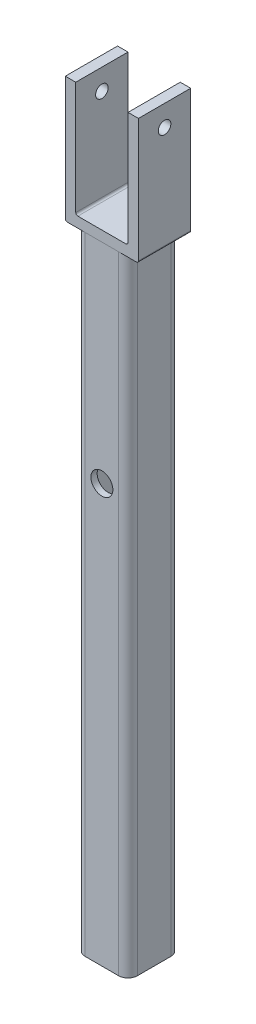
ISO-10303-21;
HEADER;
FILE_DESCRIPTION(('STEP AP214'),'2;1');
FILE_NAME('part.step','',(''),(''),'','','');
FILE_SCHEMA(('AUTOMOTIVE_DESIGN { 1 0 10303 214 1 1 1 1 }'));
ENDSEC;
DATA;
#1=APPLICATION_CONTEXT('core data for automotive mechanical design processes');
#2=APPLICATION_PROTOCOL_DEFINITION('international standard','automotive_design',2000,#1);
#3=PRODUCT_CONTEXT('',#1,'mechanical');
#4=PRODUCT('Part','Part','',(#3));
#5=PRODUCT_RELATED_PRODUCT_CATEGORY('part','',(#4));
#6=PRODUCT_DEFINITION_FORMATION('','',#4);
#7=PRODUCT_DEFINITION_CONTEXT('part definition',#1,'design');
#8=PRODUCT_DEFINITION('design','',#6,#7);
#9=PRODUCT_DEFINITION_SHAPE('','',#8);
#10=(LENGTH_UNIT() NAMED_UNIT(*) SI_UNIT(.MILLI.,.METRE.));
#11=(NAMED_UNIT(*) PLANE_ANGLE_UNIT() SI_UNIT($,.RADIAN.));
#12=(NAMED_UNIT(*) SI_UNIT($,.STERADIAN.) SOLID_ANGLE_UNIT());
#13=UNCERTAINTY_MEASURE_WITH_UNIT(LENGTH_MEASURE(1.E-05),#10,'distance_accuracy_value','');
#14=(GEOMETRIC_REPRESENTATION_CONTEXT(3) GLOBAL_UNCERTAINTY_ASSIGNED_CONTEXT((#13)) GLOBAL_UNIT_ASSIGNED_CONTEXT((#10,
#11,#12)) REPRESENTATION_CONTEXT('',''));
#15=CARTESIAN_POINT('',(0.,0.,0.));
#16=DIRECTION('',(0.,0.,1.));
#17=DIRECTION('',(1.,0.,0.));
#18=AXIS2_PLACEMENT_3D('',#15,#16,#17);
#19=CARTESIAN_POINT('',(0.,360.,0.));
#20=DIRECTION('',(0.,-1.,0.));
#21=DIRECTION('',(0.,0.,-1.));
#22=AXIS2_PLACEMENT_3D('',#19,#20,#21);
#23=PLANE('',#22);
#24=DIRECTION('',(1.,0.,0.));
#25=VECTOR('',#24,1.);
#26=CARTESIAN_POINT('',(17.5,360.,12.5));
#27=LINE('',#26,#25);
#28=CARTESIAN_POINT('',(-17.5,360.,12.5));
#29=VERTEX_POINT('',#28);
#30=CARTESIAN_POINT('',(-12.5,360.,12.5));
#31=VERTEX_POINT('',#30);
#32=EDGE_CURVE('E147',#29,#31,#27,.T.);
#33=ORIENTED_EDGE('',*,*,#32,.T.);
#34=DIRECTION('',(0.,0.,1.));
#35=VECTOR('',#34,1.);
#36=CARTESIAN_POINT('',(-12.5,360.,12.5));
#37=LINE('',#36,#35);
#38=CARTESIAN_POINT('',(-12.5,360.,-12.5));
#39=VERTEX_POINT('',#38);
#40=EDGE_CURVE('E157',#39,#31,#37,.T.);
#41=ORIENTED_EDGE('',*,*,#40,.F.);
#42=DIRECTION('',(-1.,0.,0.));
#43=VECTOR('',#42,1.);
#44=CARTESIAN_POINT('',(17.5,360.,-12.5));
#45=LINE('',#44,#43);
#46=CARTESIAN_POINT('',(-17.5,360.,-12.5));
#47=VERTEX_POINT('',#46);
#48=EDGE_CURVE('E172',#39,#47,#45,.T.);
#49=ORIENTED_EDGE('',*,*,#48,.T.);
#50=DIRECTION('',(0.,0.,1.));
#51=VECTOR('',#50,1.);
#52=CARTESIAN_POINT('',(-17.5,360.,-12.5));
#53=LINE('',#52,#51);
#54=EDGE_CURVE('E167',#47,#29,#53,.T.);
#55=ORIENTED_EDGE('',*,*,#54,.T.);
#56=EDGE_LOOP('',(#33,#41,#49,#55));
#57=FACE_BOUND('',#56,.T.);
#58=ADVANCED_FACE('F52',(#57),#23,.F.);
#59=CARTESIAN_POINT('',(-17.5,360.,-12.5));
#60=DIRECTION('',(1.,0.,0.));
#61=DIRECTION('',(0.,0.,-1.));
#62=AXIS2_PLACEMENT_3D('',#59,#60,#61);
#63=PLANE('',#62);
#64=CARTESIAN_POINT('',(-17.5,350.,0.));
#65=DIRECTION('',(-1.,0.,0.));
#66=DIRECTION('',(0.,0.,1.));
#67=AXIS2_PLACEMENT_3D('',#64,#65,#66);
#68=CIRCLE('',#67,3.);
#69=CARTESIAN_POINT('',(-17.5,350.,3.));
#70=VERTEX_POINT('',#69);
#71=EDGE_CURVE('E200',#70,#70,#68,.T.);
#72=ORIENTED_EDGE('',*,*,#71,.F.);
#73=EDGE_LOOP('',(#72));
#74=FACE_BOUND('',#73,.T.);
#75=DIRECTION('',(0.,-1.,0.));
#76=VECTOR('',#75,1.);
#77=CARTESIAN_POINT('',(-17.5,360.,-12.5));
#78=LINE('',#77,#76);
#79=CARTESIAN_POINT('',(-17.5,301.,-12.5));
#80=VERTEX_POINT('',#79);
#81=EDGE_CURVE('E179',#47,#80,#78,.T.);
#82=ORIENTED_EDGE('',*,*,#81,.T.);
#83=DIRECTION('',(0.,0.,1.));
#84=VECTOR('',#83,1.);
#85=CARTESIAN_POINT('',(-17.5,301.,12.5));
#86=LINE('',#85,#84);
#87=CARTESIAN_POINT('',(-17.5,301.,12.5));
#88=VERTEX_POINT('',#87);
#89=EDGE_CURVE('E13',#80,#88,#86,.T.);
#90=ORIENTED_EDGE('',*,*,#89,.T.);
#91=DIRECTION('',(0.,-1.,0.));
#92=VECTOR('',#91,1.);
#93=CARTESIAN_POINT('',(-17.5,360.,12.5));
#94=LINE('',#93,#92);
#95=EDGE_CURVE('E193',#29,#88,#94,.T.);
#96=ORIENTED_EDGE('',*,*,#95,.F.);
#97=ORIENTED_EDGE('',*,*,#54,.F.);
#98=EDGE_LOOP('',(#82,#90,#96,#97));
#99=FACE_BOUND('',#98,.T.);
#100=ADVANCED_FACE('F244',(#74,#99),#63,.F.);
#101=CARTESIAN_POINT('',(17.5,360.,12.5));
#102=DIRECTION('',(0.,0.,-1.));
#103=DIRECTION('',(-1.,0.,0.));
#104=AXIS2_PLACEMENT_3D('',#101,#102,#103);
#105=PLANE('',#104);
#106=DIRECTION('',(1.,0.,0.));
#107=VECTOR('',#106,1.);
#108=CARTESIAN_POINT('',(17.5,300.,12.5));
#109=LINE('',#108,#107);
#110=CARTESIAN_POINT('',(-16.5,300.,12.5));
#111=VERTEX_POINT('',#110);
#112=CARTESIAN_POINT('',(16.5,300.,12.5));
#113=VERTEX_POINT('',#112);
#114=EDGE_CURVE('E180',#111,#113,#109,.T.);
#115=ORIENTED_EDGE('',*,*,#114,.T.);
#116=CARTESIAN_POINT('',(16.5,301.,12.5));
#117=DIRECTION('',(0.,0.,-1.));
#118=DIRECTION('',(-1.,0.,0.));
#119=AXIS2_PLACEMENT_3D('',#116,#117,#118);
#120=CIRCLE('',#119,1.);
#121=CARTESIAN_POINT('',(17.5,301.,12.5));
#122=VERTEX_POINT('',#121);
#123=EDGE_CURVE('E60',#113,#122,#120,.F.);
#124=ORIENTED_EDGE('',*,*,#123,.T.);
#125=DIRECTION('',(0.,-1.,0.));
#126=VECTOR('',#125,1.);
#127=CARTESIAN_POINT('',(17.5,360.,12.5));
#128=LINE('',#127,#126);
#129=CARTESIAN_POINT('',(17.5,360.,12.5));
#130=VERTEX_POINT('',#129);
#131=EDGE_CURVE('E190',#130,#122,#128,.T.);
#132=ORIENTED_EDGE('',*,*,#131,.F.);
#133=CARTESIAN_POINT('',(12.5,360.,12.5));
#134=VERTEX_POINT('',#133);
#135=EDGE_CURVE('E170',#134,#130,#27,.T.);
#136=ORIENTED_EDGE('',*,*,#135,.F.);
#137=DIRECTION('',(0.,1.,0.));
#138=VECTOR('',#137,1.);
#139=CARTESIAN_POINT('',(12.5,305.,12.5));
#140=LINE('',#139,#138);
#141=CARTESIAN_POINT('',(12.5,306.,12.5));
#142=VERTEX_POINT('',#141);
#143=EDGE_CURVE('E153',#142,#134,#140,.T.);
#144=ORIENTED_EDGE('',*,*,#143,.F.);
#145=CARTESIAN_POINT('',(11.5,306.,12.5));
#146=DIRECTION('',(0.,0.,-1.));
#147=DIRECTION('',(-1.,0.,0.));
#148=AXIS2_PLACEMENT_3D('',#145,#146,#147);
#149=CIRCLE('',#148,1.);
#150=CARTESIAN_POINT('',(11.5,305.,12.5));
#151=VERTEX_POINT('',#150);
#152=EDGE_CURVE('E212',#142,#151,#149,.T.);
#153=ORIENTED_EDGE('',*,*,#152,.T.);
#154=DIRECTION('',(1.,0.,0.));
#155=VECTOR('',#154,1.);
#156=CARTESIAN_POINT('',(12.5,305.,12.5));
#157=LINE('',#156,#155);
#158=CARTESIAN_POINT('',(-11.5,305.,12.5));
#159=VERTEX_POINT('',#158);
#160=EDGE_CURVE('E396',#159,#151,#157,.T.);
#161=ORIENTED_EDGE('',*,*,#160,.F.);
#162=CARTESIAN_POINT('',(-11.5,306.,12.5));
#163=DIRECTION('',(0.,0.,-1.));
#164=DIRECTION('',(-1.,0.,0.));
#165=AXIS2_PLACEMENT_3D('',#162,#163,#164);
#166=CIRCLE('',#165,1.);
#167=CARTESIAN_POINT('',(-12.5,306.,12.5));
#168=VERTEX_POINT('',#167);
#169=EDGE_CURVE('E150',#159,#168,#166,.T.);
#170=ORIENTED_EDGE('',*,*,#169,.T.);
#171=DIRECTION('',(0.,1.,0.));
#172=VECTOR('',#171,1.);
#173=CARTESIAN_POINT('',(-12.5,305.,12.5));
#174=LINE('',#173,#172);
#175=EDGE_CURVE('E142',#168,#31,#174,.T.);
#176=ORIENTED_EDGE('',*,*,#175,.T.);
#177=ORIENTED_EDGE('',*,*,#32,.F.);
#178=ORIENTED_EDGE('',*,*,#95,.T.);
#179=CARTESIAN_POINT('',(-16.5,301.,12.5));
#180=DIRECTION('',(0.,0.,-1.));
#181=DIRECTION('',(-1.,0.,0.));
#182=AXIS2_PLACEMENT_3D('',#179,#180,#181);
#183=CIRCLE('',#182,1.);
#184=EDGE_CURVE('E67',#88,#111,#183,.F.);
#185=ORIENTED_EDGE('',*,*,#184,.T.);
#186=EDGE_LOOP('',(#115,#124,#132,#136,#144,#153,#161,#170,#176,#177,#178,#185));
#187=FACE_BOUND('',#186,.T.);
#188=ADVANCED_FACE('F144',(#187),#105,.F.);
#189=CARTESIAN_POINT('',(17.5,360.,-12.5));
#190=DIRECTION('',(-1.,0.,0.));
#191=DIRECTION('',(0.,0.,1.));
#192=AXIS2_PLACEMENT_3D('',#189,#190,#191);
#193=PLANE('',#192);
#194=CARTESIAN_POINT('',(17.5,350.,0.));
#195=DIRECTION('',(-1.,0.,0.));
#196=DIRECTION('',(0.,0.,1.));
#197=AXIS2_PLACEMENT_3D('',#194,#195,#196);
#198=CIRCLE('',#197,3.);
#199=CARTESIAN_POINT('',(17.5,350.,3.));
#200=VERTEX_POINT('',#199);
#201=EDGE_CURVE('E164',#200,#200,#198,.T.);
#202=ORIENTED_EDGE('',*,*,#201,.T.);
#203=EDGE_LOOP('',(#202));
#204=FACE_BOUND('',#203,.T.);
#205=ORIENTED_EDGE('',*,*,#131,.T.);
#206=DIRECTION('',(0.,0.,-1.));
#207=VECTOR('',#206,1.);
#208=CARTESIAN_POINT('',(17.5,301.,-12.5));
#209=LINE('',#208,#207);
#210=CARTESIAN_POINT('',(17.5,301.,-12.5));
#211=VERTEX_POINT('',#210);
#212=EDGE_CURVE('E217',#122,#211,#209,.T.);
#213=ORIENTED_EDGE('',*,*,#212,.T.);
#214=DIRECTION('',(0.,-1.,0.));
#215=VECTOR('',#214,1.);
#216=CARTESIAN_POINT('',(17.5,360.,-12.5));
#217=LINE('',#216,#215);
#218=CARTESIAN_POINT('',(17.5,360.,-12.5));
#219=VERTEX_POINT('',#218);
#220=EDGE_CURVE('E187',#219,#211,#217,.T.);
#221=ORIENTED_EDGE('',*,*,#220,.F.);
#222=DIRECTION('',(0.,0.,-1.));
#223=VECTOR('',#222,1.);
#224=CARTESIAN_POINT('',(17.5,360.,-12.5));
#225=LINE('',#224,#223);
#226=EDGE_CURVE('E169',#130,#219,#225,.T.);
#227=ORIENTED_EDGE('',*,*,#226,.F.);
#228=EDGE_LOOP('',(#205,#213,#221,#227));
#229=FACE_BOUND('',#228,.T.);
#230=ADVANCED_FACE('F234',(#204,#229),#193,.F.);
#231=CARTESIAN_POINT('',(17.5,360.,-12.5));
#232=DIRECTION('',(0.,0.,1.));
#233=DIRECTION('',(1.,0.,0.));
#234=AXIS2_PLACEMENT_3D('',#231,#232,#233);
#235=PLANE('',#234);
#236=ORIENTED_EDGE('',*,*,#220,.T.);
#237=CARTESIAN_POINT('',(16.5,301.,-12.5));
#238=DIRECTION('',(0.,0.,1.));
#239=DIRECTION('',(1.,0.,0.));
#240=AXIS2_PLACEMENT_3D('',#237,#238,#239);
#241=CIRCLE('',#240,1.);
#242=CARTESIAN_POINT('',(16.5,300.,-12.5));
#243=VERTEX_POINT('',#242);
#244=EDGE_CURVE('E222',#211,#243,#241,.F.);
#245=ORIENTED_EDGE('',*,*,#244,.T.);
#246=DIRECTION('',(-1.,0.,0.));
#247=VECTOR('',#246,1.);
#248=CARTESIAN_POINT('',(17.5,300.,-12.5));
#249=LINE('',#248,#247);
#250=CARTESIAN_POINT('',(-16.5,300.,-12.5));
#251=VERTEX_POINT('',#250);
#252=EDGE_CURVE('E182',#243,#251,#249,.T.);
#253=ORIENTED_EDGE('',*,*,#252,.T.);
#254=CARTESIAN_POINT('',(-16.5,301.,-12.5));
#255=DIRECTION('',(0.,0.,1.));
#256=DIRECTION('',(1.,0.,0.));
#257=AXIS2_PLACEMENT_3D('',#254,#255,#256);
#258=CIRCLE('',#257,1.);
#259=EDGE_CURVE('E220',#251,#80,#258,.F.);
#260=ORIENTED_EDGE('',*,*,#259,.T.);
#261=ORIENTED_EDGE('',*,*,#81,.F.);
#262=ORIENTED_EDGE('',*,*,#48,.F.);
#263=DIRECTION('',(0.,1.,0.));
#264=VECTOR('',#263,1.);
#265=CARTESIAN_POINT('',(-12.5,305.,-12.5));
#266=LINE('',#265,#264);
#267=CARTESIAN_POINT('',(-12.5,306.,-12.5));
#268=VERTEX_POINT('',#267);
#269=EDGE_CURVE('E160',#268,#39,#266,.T.);
#270=ORIENTED_EDGE('',*,*,#269,.F.);
#271=CARTESIAN_POINT('',(-11.5,306.,-12.5));
#272=DIRECTION('',(0.,0.,1.));
#273=DIRECTION('',(1.,0.,0.));
#274=AXIS2_PLACEMENT_3D('',#271,#272,#273);
#275=CIRCLE('',#274,1.);
#276=CARTESIAN_POINT('',(-11.5,305.,-12.5));
#277=VERTEX_POINT('',#276);
#278=EDGE_CURVE('E215',#268,#277,#275,.T.);
#279=ORIENTED_EDGE('',*,*,#278,.T.);
#280=DIRECTION('',(-1.,0.,0.));
#281=VECTOR('',#280,1.);
#282=CARTESIAN_POINT('',(12.5,305.,-12.5));
#283=LINE('',#282,#281);
#284=CARTESIAN_POINT('',(11.5,305.,-12.5));
#285=VERTEX_POINT('',#284);
#286=EDGE_CURVE('E154',#285,#277,#283,.T.);
#287=ORIENTED_EDGE('',*,*,#286,.F.);
#288=CARTESIAN_POINT('',(11.5,306.,-12.5));
#289=DIRECTION('',(0.,0.,1.));
#290=DIRECTION('',(1.,0.,0.));
#291=AXIS2_PLACEMENT_3D('',#288,#289,#290);
#292=CIRCLE('',#291,1.);
#293=CARTESIAN_POINT('',(12.5,306.,-12.5));
#294=VERTEX_POINT('',#293);
#295=EDGE_CURVE('E210',#285,#294,#292,.T.);
#296=ORIENTED_EDGE('',*,*,#295,.T.);
#297=DIRECTION('',(0.,1.,0.));
#298=VECTOR('',#297,1.);
#299=CARTESIAN_POINT('',(12.5,305.,-12.5));
#300=LINE('',#299,#298);
#301=CARTESIAN_POINT('',(12.5,360.,-12.5));
#302=VERTEX_POINT('',#301);
#303=EDGE_CURVE('E390',#294,#302,#300,.T.);
#304=ORIENTED_EDGE('',*,*,#303,.T.);
#305=EDGE_CURVE('E176',#219,#302,#45,.T.);
#306=ORIENTED_EDGE('',*,*,#305,.F.);
#307=EDGE_LOOP('',(#236,#245,#253,#260,#261,#262,#270,#279,#287,#296,#304,#306));
#308=FACE_BOUND('',#307,.T.);
#309=ADVANCED_FACE('F238',(#308),#235,.F.);
#310=ORIENTED_EDGE('',*,*,#305,.T.);
#311=DIRECTION('',(0.,0.,-1.));
#312=VECTOR('',#311,1.);
#313=CARTESIAN_POINT('',(12.5,360.,12.5));
#314=LINE('',#313,#312);
#315=EDGE_CURVE('E163',#134,#302,#314,.T.);
#316=ORIENTED_EDGE('',*,*,#315,.F.);
#317=ORIENTED_EDGE('',*,*,#135,.T.);
#318=ORIENTED_EDGE('',*,*,#226,.T.);
#319=EDGE_LOOP('',(#310,#316,#317,#318));
#320=FACE_BOUND('',#319,.T.);
#321=ADVANCED_FACE('F254',(#320),#23,.F.);
#322=CARTESIAN_POINT('',(0.,300.,0.));
#323=DIRECTION('',(0.,-1.,0.));
#324=DIRECTION('',(0.,0.,-1.));
#325=AXIS2_PLACEMENT_3D('',#322,#323,#324);
#326=PLANE('',#325);
#327=ORIENTED_EDGE('',*,*,#252,.F.);
#328=DIRECTION('',(0.,0.,-1.));
#329=VECTOR('',#328,1.);
#330=CARTESIAN_POINT('',(16.5,300.,12.5));
#331=LINE('',#330,#329);
#332=EDGE_CURVE('E74',#243,#113,#331,.F.);
#333=ORIENTED_EDGE('',*,*,#332,.T.);
#334=ORIENTED_EDGE('',*,*,#114,.F.);
#335=DIRECTION('',(0.,0.,1.));
#336=VECTOR('',#335,1.);
#337=CARTESIAN_POINT('',(-16.5,300.,-12.5));
#338=LINE('',#337,#336);
#339=EDGE_CURVE('E224',#111,#251,#338,.F.);
#340=ORIENTED_EDGE('',*,*,#339,.T.);
#341=EDGE_LOOP('',(#327,#333,#334,#340));
#342=FACE_BOUND('',#341,.T.);
#343=ADVANCED_FACE('F241',(#342),#326,.T.);
#344=CARTESIAN_POINT('',(-12.5,305.,12.5));
#345=DIRECTION('',(-1.,0.,0.));
#346=DIRECTION('',(0.,0.,1.));
#347=AXIS2_PLACEMENT_3D('',#344,#345,#346);
#348=PLANE('',#347);
#349=CARTESIAN_POINT('',(-12.5,350.,0.));
#350=DIRECTION('',(-1.,0.,0.));
#351=DIRECTION('',(0.,0.,1.));
#352=AXIS2_PLACEMENT_3D('',#349,#350,#351);
#353=CIRCLE('',#352,3.);
#354=CARTESIAN_POINT('',(-12.5,350.,3.));
#355=VERTEX_POINT('',#354);
#356=EDGE_CURVE('E199',#355,#355,#353,.T.);
#357=ORIENTED_EDGE('',*,*,#356,.T.);
#358=EDGE_LOOP('',(#357));
#359=FACE_BOUND('',#358,.T.);
#360=ORIENTED_EDGE('',*,*,#175,.F.);
#361=DIRECTION('',(0.,0.,1.));
#362=VECTOR('',#361,1.);
#363=CARTESIAN_POINT('',(-12.5,306.,12.5));
#364=LINE('',#363,#362);
#365=EDGE_CURVE('E208',#168,#268,#364,.F.);
#366=ORIENTED_EDGE('',*,*,#365,.T.);
#367=ORIENTED_EDGE('',*,*,#269,.T.);
#368=ORIENTED_EDGE('',*,*,#40,.T.);
#369=EDGE_LOOP('',(#360,#366,#367,#368));
#370=FACE_BOUND('',#369,.T.);
#371=ADVANCED_FACE('F158',(#359,#370),#348,.F.);
#372=CARTESIAN_POINT('',(12.5,305.,12.5));
#373=DIRECTION('',(1.,0.,0.));
#374=DIRECTION('',(0.,0.,-1.));
#375=AXIS2_PLACEMENT_3D('',#372,#373,#374);
#376=PLANE('',#375);
#377=CARTESIAN_POINT('',(12.5,350.,0.));
#378=DIRECTION('',(1.,0.,0.));
#379=DIRECTION('',(0.,0.,-1.));
#380=AXIS2_PLACEMENT_3D('',#377,#378,#379);
#381=CIRCLE('',#380,3.);
#382=CARTESIAN_POINT('',(12.5,350.,-3.));
#383=VERTEX_POINT('',#382);
#384=EDGE_CURVE('E196',#383,#383,#381,.T.);
#385=ORIENTED_EDGE('',*,*,#384,.T.);
#386=EDGE_LOOP('',(#385));
#387=FACE_BOUND('',#386,.T.);
#388=ORIENTED_EDGE('',*,*,#303,.F.);
#389=DIRECTION('',(0.,0.,-1.));
#390=VECTOR('',#389,1.);
#391=CARTESIAN_POINT('',(12.5,306.,12.5));
#392=LINE('',#391,#390);
#393=EDGE_CURVE('E206',#294,#142,#392,.F.);
#394=ORIENTED_EDGE('',*,*,#393,.T.);
#395=ORIENTED_EDGE('',*,*,#143,.T.);
#396=ORIENTED_EDGE('',*,*,#315,.T.);
#397=EDGE_LOOP('',(#388,#394,#395,#396));
#398=FACE_BOUND('',#397,.T.);
#399=ADVANCED_FACE('F339',(#387,#398),#376,.F.);
#400=CARTESIAN_POINT('',(0.,305.,0.));
#401=DIRECTION('',(0.,1.,0.));
#402=DIRECTION('',(0.,0.,1.));
#403=AXIS2_PLACEMENT_3D('',#400,#401,#402);
#404=PLANE('',#403);
#405=ORIENTED_EDGE('',*,*,#160,.T.);
#406=DIRECTION('',(0.,0.,-1.));
#407=VECTOR('',#406,1.);
#408=CARTESIAN_POINT('',(11.5,305.,0.));
#409=LINE('',#408,#407);
#410=EDGE_CURVE('E203',#151,#285,#409,.T.);
#411=ORIENTED_EDGE('',*,*,#410,.T.);
#412=ORIENTED_EDGE('',*,*,#286,.T.);
#413=DIRECTION('',(0.,0.,1.));
#414=VECTOR('',#413,1.);
#415=CARTESIAN_POINT('',(-11.5,305.,0.));
#416=LINE('',#415,#414);
#417=EDGE_CURVE('E195',#277,#159,#416,.T.);
#418=ORIENTED_EDGE('',*,*,#417,.T.);
#419=EDGE_LOOP('',(#405,#411,#412,#418));
#420=FACE_BOUND('',#419,.T.);
#421=ADVANCED_FACE('F333',(#420),#404,.T.);
#422=CARTESIAN_POINT('',(37.5,350.,0.));
#423=DIRECTION('',(-1.,0.,0.));
#424=DIRECTION('',(0.,0.,1.));
#425=AXIS2_PLACEMENT_3D('',#422,#423,#424);
#426=CYLINDRICAL_SURFACE('',#425,3.);
#427=ORIENTED_EDGE('',*,*,#384,.F.);
#428=EDGE_LOOP('',(#427));
#429=FACE_BOUND('',#428,.T.);
#430=ORIENTED_EDGE('',*,*,#201,.F.);
#431=EDGE_LOOP('',(#430));
#432=FACE_BOUND('',#431,.T.);
#433=ADVANCED_FACE('F338',(#429,#432),#426,.F.);
#434=ORIENTED_EDGE('',*,*,#71,.T.);
#435=EDGE_LOOP('',(#434));
#436=FACE_BOUND('',#435,.T.);
#437=ORIENTED_EDGE('',*,*,#356,.F.);
#438=EDGE_LOOP('',(#437));
#439=FACE_BOUND('',#438,.T.);
#440=ADVANCED_FACE('F262',(#436,#439),#426,.F.);
#441=CARTESIAN_POINT('',(11.5,306.,0.));
#442=DIRECTION('',(0.,0.,-1.));
#443=DIRECTION('',(-1.,0.,0.));
#444=AXIS2_PLACEMENT_3D('',#441,#442,#443);
#445=CYLINDRICAL_SURFACE('',#444,1.);
#446=ORIENTED_EDGE('',*,*,#152,.F.);
#447=ORIENTED_EDGE('',*,*,#393,.F.);
#448=ORIENTED_EDGE('',*,*,#295,.F.);
#449=ORIENTED_EDGE('',*,*,#410,.F.);
#450=EDGE_LOOP('',(#446,#447,#448,#449));
#451=FACE_BOUND('',#450,.T.);
#452=ADVANCED_FACE('F258',(#451),#445,.F.);
#453=CARTESIAN_POINT('',(-11.5,306.,0.));
#454=DIRECTION('',(0.,0.,1.));
#455=DIRECTION('',(1.,0.,0.));
#456=AXIS2_PLACEMENT_3D('',#453,#454,#455);
#457=CYLINDRICAL_SURFACE('',#456,1.);
#458=ORIENTED_EDGE('',*,*,#278,.F.);
#459=ORIENTED_EDGE('',*,*,#365,.F.);
#460=ORIENTED_EDGE('',*,*,#169,.F.);
#461=ORIENTED_EDGE('',*,*,#417,.F.);
#462=EDGE_LOOP('',(#458,#459,#460,#461));
#463=FACE_BOUND('',#462,.T.);
#464=ADVANCED_FACE('F261',(#463),#457,.F.);
#465=CARTESIAN_POINT('',(16.5,301.,-12.5));
#466=DIRECTION('',(0.,0.,1.));
#467=DIRECTION('',(1.,0.,0.));
#468=AXIS2_PLACEMENT_3D('',#465,#466,#467);
#469=CYLINDRICAL_SURFACE('',#468,1.);
#470=ORIENTED_EDGE('',*,*,#123,.F.);
#471=ORIENTED_EDGE('',*,*,#332,.F.);
#472=ORIENTED_EDGE('',*,*,#244,.F.);
#473=ORIENTED_EDGE('',*,*,#212,.F.);
#474=EDGE_LOOP('',(#470,#471,#472,#473));
#475=FACE_BOUND('',#474,.T.);
#476=ADVANCED_FACE('F236',(#475),#469,.T.);
#477=CARTESIAN_POINT('',(-16.5,301.,-12.5));
#478=DIRECTION('',(0.,0.,-1.));
#479=DIRECTION('',(-1.,0.,0.));
#480=AXIS2_PLACEMENT_3D('',#477,#478,#479);
#481=CYLINDRICAL_SURFACE('',#480,1.);
#482=ORIENTED_EDGE('',*,*,#259,.F.);
#483=ORIENTED_EDGE('',*,*,#339,.F.);
#484=ORIENTED_EDGE('',*,*,#184,.F.);
#485=ORIENTED_EDGE('',*,*,#89,.F.);
#486=EDGE_LOOP('',(#482,#483,#484,#485));
#487=FACE_BOUND('',#486,.T.);
#488=ADVANCED_FACE('F54',(#487),#481,.T.);
#489=CLOSED_SHELL('',(#58,#100,#188,#230,#309,#321,#343,#371,#399,#421,#433,#440,#452,#464,#476,#488));
#490=MANIFOLD_SOLID_BREP('B2',#489);
#491=CARTESIAN_POINT('',(-6.49999999999998,300.,-9.5));
#492=DIRECTION('',(0.,0.,1.));
#493=DIRECTION('',(1.,0.,0.));
#494=AXIS2_PLACEMENT_3D('',#491,#492,#493);
#495=PLANE('',#494);
#496=CARTESIAN_POINT('',(0.,200.,-9.49999999999999));
#497=DIRECTION('',(0.,0.,-1.));
#498=DIRECTION('',(-1.,0.,0.));
#499=AXIS2_PLACEMENT_3D('',#496,#497,#498);
#500=CIRCLE('',#499,7.5);
#501=CARTESIAN_POINT('',(-6.49999999999998,203.741657386774,-9.49999999999999));
#502=VERTEX_POINT('',#501);
#503=CARTESIAN_POINT('',(6.49999999999998,203.741657386774,-9.5));
#504=VERTEX_POINT('',#503);
#505=EDGE_CURVE('E552',#502,#504,#500,.T.);
#506=ORIENTED_EDGE('',*,*,#505,.T.);
#507=DIRECTION('',(0.,-1.,0.));
#508=VECTOR('',#507,1.);
#509=CARTESIAN_POINT('',(6.49999999999997,300.,-9.5));
#510=LINE('',#509,#508);
#511=CARTESIAN_POINT('',(6.49999999999997,300.,-9.5));
#512=VERTEX_POINT('',#511);
#513=EDGE_CURVE('E444',#512,#504,#510,.T.);
#514=ORIENTED_EDGE('',*,*,#513,.F.);
#515=DIRECTION('',(-1.,0.,0.));
#516=VECTOR('',#515,1.);
#517=CARTESIAN_POINT('',(-6.49999999999998,300.,-9.5));
#518=LINE('',#517,#516);
#519=CARTESIAN_POINT('',(-6.49999999999998,300.,-9.5));
#520=VERTEX_POINT('',#519);
#521=EDGE_CURVE('E569',#512,#520,#518,.T.);
#522=ORIENTED_EDGE('',*,*,#521,.T.);
#523=DIRECTION('',(0.,-1.,0.));
#524=VECTOR('',#523,1.);
#525=CARTESIAN_POINT('',(-6.49999999999998,300.,-9.5));
#526=LINE('',#525,#524);
#527=EDGE_CURVE('E564',#520,#502,#526,.T.);
#528=ORIENTED_EDGE('',*,*,#527,.T.);
#529=EDGE_LOOP('',(#506,#514,#522,#528));
#530=FACE_BOUND('',#529,.T.);
#531=ADVANCED_FACE('F422',(#530),#495,.T.);
#532=CARTESIAN_POINT('',(-8.00000000000001,300.,-8.));
#533=DIRECTION('',(0.,-1.,0.));
#534=DIRECTION('',(0.,0.,-1.));
#535=AXIS2_PLACEMENT_3D('',#532,#533,#534);
#536=PLANE('',#535);
#537=CARTESIAN_POINT('',(-8.00000000000001,300.,-8.));
#538=DIRECTION('',(0.,1.,0.));
#539=DIRECTION('',(0.,0.,-1.));
#540=AXIS2_PLACEMENT_3D('',#537,#538,#539);
#541=CIRCLE('',#540,4.5);
#542=CARTESIAN_POINT('',(-7.99999999999998,300.,-12.5));
#543=VERTEX_POINT('',#542);
#544=CARTESIAN_POINT('',(-12.5,300.,-7.99999999999996));
#545=VERTEX_POINT('',#544);
#546=EDGE_CURVE('E653',#543,#545,#541,.T.);
#547=ORIENTED_EDGE('',*,*,#546,.T.);
#548=DIRECTION('',(0.,0.,1.));
#549=VECTOR('',#548,1.);
#550=CARTESIAN_POINT('',(-12.5,300.,-7.99999999999996));
#551=LINE('',#550,#549);
#552=CARTESIAN_POINT('',(-12.5,300.,7.99999999999998));
#553=VERTEX_POINT('',#552);
#554=EDGE_CURVE('E656',#545,#553,#551,.T.);
#555=ORIENTED_EDGE('',*,*,#554,.T.);
#556=CARTESIAN_POINT('',(-8.00000000000001,300.,8.00000000000001));
#557=DIRECTION('',(0.,1.,0.));
#558=DIRECTION('',(0.,0.,-1.));
#559=AXIS2_PLACEMENT_3D('',#556,#557,#558);
#560=CIRCLE('',#559,4.5);
#561=CARTESIAN_POINT('',(-7.99999999999998,300.,12.5));
#562=VERTEX_POINT('',#561);
#563=EDGE_CURVE('E659',#553,#562,#560,.T.);
#564=ORIENTED_EDGE('',*,*,#563,.T.);
#565=DIRECTION('',(1.,0.,0.));
#566=VECTOR('',#565,1.);
#567=CARTESIAN_POINT('',(7.99999999999998,300.,12.5));
#568=LINE('',#567,#566);
#569=CARTESIAN_POINT('',(7.99999999999998,300.,12.5));
#570=VERTEX_POINT('',#569);
#571=EDGE_CURVE('E661',#562,#570,#568,.T.);
#572=ORIENTED_EDGE('',*,*,#571,.T.);
#573=CARTESIAN_POINT('',(8.00000000000001,300.,8.00000000000001));
#574=DIRECTION('',(0.,1.,0.));
#575=DIRECTION('',(0.,0.,-1.));
#576=AXIS2_PLACEMENT_3D('',#573,#574,#575);
#577=CIRCLE('',#576,4.5);
#578=CARTESIAN_POINT('',(12.5,300.,7.99999999999997));
#579=VERTEX_POINT('',#578);
#580=EDGE_CURVE('E663',#570,#579,#577,.T.);
#581=ORIENTED_EDGE('',*,*,#580,.T.);
#582=DIRECTION('',(0.,0.,-1.));
#583=VECTOR('',#582,1.);
#584=CARTESIAN_POINT('',(12.5,300.,-7.99999999999997));
#585=LINE('',#584,#583);
#586=CARTESIAN_POINT('',(12.5,300.,-7.99999999999997));
#587=VERTEX_POINT('',#586);
#588=EDGE_CURVE('E665',#579,#587,#585,.T.);
#589=ORIENTED_EDGE('',*,*,#588,.T.);
#590=CARTESIAN_POINT('',(8.00000000000001,300.,-8.));
#591=DIRECTION('',(0.,1.,0.));
#592=DIRECTION('',(0.,0.,-1.));
#593=AXIS2_PLACEMENT_3D('',#590,#591,#592);
#594=CIRCLE('',#593,4.5);
#595=CARTESIAN_POINT('',(7.99999999999997,300.,-12.5));
#596=VERTEX_POINT('',#595);
#597=EDGE_CURVE('E667',#587,#596,#594,.T.);
#598=ORIENTED_EDGE('',*,*,#597,.T.);
#599=DIRECTION('',(-1.,0.,0.));
#600=VECTOR('',#599,1.);
#601=CARTESIAN_POINT('',(7.99999999999997,300.,-12.5));
#602=LINE('',#601,#600);
#603=EDGE_CURVE('E669',#596,#543,#602,.T.);
#604=ORIENTED_EDGE('',*,*,#603,.T.);
#605=EDGE_LOOP('',(#547,#555,#564,#572,#581,#589,#598,#604));
#606=FACE_BOUND('',#605,.T.);
#607=CARTESIAN_POINT('',(-6.50000000000001,300.,-6.5));
#608=DIRECTION('',(0.,1.,0.));
#609=DIRECTION('',(0.,0.,-1.));
#610=AXIS2_PLACEMENT_3D('',#607,#608,#609);
#611=CIRCLE('',#610,3.);
#612=CARTESIAN_POINT('',(-9.50000000000001,300.,-6.49999999999998));
#613=VERTEX_POINT('',#612);
#614=EDGE_CURVE('E603',#520,#613,#611,.T.);
#615=ORIENTED_EDGE('',*,*,#614,.F.);
#616=ORIENTED_EDGE('',*,*,#521,.F.);
#617=CARTESIAN_POINT('',(6.5,300.,-6.5));
#618=DIRECTION('',(0.,1.,0.));
#619=DIRECTION('',(0.,0.,-1.));
#620=AXIS2_PLACEMENT_3D('',#617,#618,#619);
#621=CIRCLE('',#620,3.);
#622=CARTESIAN_POINT('',(9.49999999999999,300.,-6.49999999999998));
#623=VERTEX_POINT('',#622);
#624=EDGE_CURVE('E576',#623,#512,#621,.T.);
#625=ORIENTED_EDGE('',*,*,#624,.F.);
#626=DIRECTION('',(0.,0.,-1.));
#627=VECTOR('',#626,1.);
#628=CARTESIAN_POINT('',(9.49999999999999,300.,-6.49999999999998));
#629=LINE('',#628,#627);
#630=CARTESIAN_POINT('',(9.5,300.,6.49999999999998));
#631=VERTEX_POINT('',#630);
#632=EDGE_CURVE('E578',#631,#623,#629,.T.);
#633=ORIENTED_EDGE('',*,*,#632,.F.);
#634=CARTESIAN_POINT('',(6.5,300.,6.5));
#635=DIRECTION('',(0.,1.,0.));
#636=DIRECTION('',(0.,0.,-1.));
#637=AXIS2_PLACEMENT_3D('',#634,#635,#636);
#638=CIRCLE('',#637,3.);
#639=CARTESIAN_POINT('',(6.49999999999998,300.,9.5));
#640=VERTEX_POINT('',#639);
#641=EDGE_CURVE('E616',#640,#631,#638,.T.);
#642=ORIENTED_EDGE('',*,*,#641,.F.);
#643=DIRECTION('',(1.,0.,0.));
#644=VECTOR('',#643,1.);
#645=CARTESIAN_POINT('',(-6.49999999999998,300.,9.5));
#646=LINE('',#645,#644);
#647=CARTESIAN_POINT('',(-6.49999999999998,300.,9.5));
#648=VERTEX_POINT('',#647);
#649=EDGE_CURVE('E614',#648,#640,#646,.T.);
#650=ORIENTED_EDGE('',*,*,#649,.F.);
#651=CARTESIAN_POINT('',(-6.5,300.,6.5));
#652=DIRECTION('',(0.,1.,0.));
#653=DIRECTION('',(0.,0.,-1.));
#654=AXIS2_PLACEMENT_3D('',#651,#652,#653);
#655=CIRCLE('',#654,3.);
#656=CARTESIAN_POINT('',(-9.5,300.,6.49999999999998));
#657=VERTEX_POINT('',#656);
#658=EDGE_CURVE('E609',#657,#648,#655,.T.);
#659=ORIENTED_EDGE('',*,*,#658,.F.);
#660=DIRECTION('',(0.,0.,1.));
#661=VECTOR('',#660,1.);
#662=CARTESIAN_POINT('',(-9.50000000000001,300.,-6.49999999999998));
#663=LINE('',#662,#661);
#664=EDGE_CURVE('E605',#613,#657,#663,.T.);
#665=ORIENTED_EDGE('',*,*,#664,.F.);
#666=EDGE_LOOP('',(#615,#616,#625,#633,#642,#650,#659,#665));
#667=FACE_BOUND('',#666,.T.);
#668=ADVANCED_FACE('F632',(#606,#667),#536,.F.);
#669=CARTESIAN_POINT('',(-8.00000000000001,0.,-8.));
#670=DIRECTION('',(0.,-1.,0.));
#671=DIRECTION('',(0.,0.,-1.));
#672=AXIS2_PLACEMENT_3D('',#669,#670,#671);
#673=PLANE('',#672);
#674=CARTESIAN_POINT('',(-8.00000000000001,0.,-8.));
#675=DIRECTION('',(0.,1.,0.));
#676=DIRECTION('',(0.,0.,-1.));
#677=AXIS2_PLACEMENT_3D('',#674,#675,#676);
#678=CIRCLE('',#677,4.5);
#679=CARTESIAN_POINT('',(-7.99999999999998,0.,-12.5));
#680=VERTEX_POINT('',#679);
#681=CARTESIAN_POINT('',(-12.5,0.,-7.99999999999996));
#682=VERTEX_POINT('',#681);
#683=EDGE_CURVE('E647',#680,#682,#678,.T.);
#684=ORIENTED_EDGE('',*,*,#683,.F.);
#685=DIRECTION('',(-1.,0.,0.));
#686=VECTOR('',#685,1.);
#687=CARTESIAN_POINT('',(7.99999999999997,0.,-12.5));
#688=LINE('',#687,#686);
#689=CARTESIAN_POINT('',(7.99999999999997,0.,-12.5));
#690=VERTEX_POINT('',#689);
#691=EDGE_CURVE('E657',#690,#680,#688,.T.);
#692=ORIENTED_EDGE('',*,*,#691,.F.);
#693=CARTESIAN_POINT('',(8.00000000000001,0.,-8.));
#694=DIRECTION('',(0.,1.,0.));
#695=DIRECTION('',(0.,0.,-1.));
#696=AXIS2_PLACEMENT_3D('',#693,#694,#695);
#697=CIRCLE('',#696,4.5);
#698=CARTESIAN_POINT('',(12.5,0.,-7.99999999999997));
#699=VERTEX_POINT('',#698);
#700=EDGE_CURVE('E684',#699,#690,#697,.T.);
#701=ORIENTED_EDGE('',*,*,#700,.F.);
#702=DIRECTION('',(0.,0.,-1.));
#703=VECTOR('',#702,1.);
#704=CARTESIAN_POINT('',(12.5,0.,-7.99999999999997));
#705=LINE('',#704,#703);
#706=CARTESIAN_POINT('',(12.5,0.,7.99999999999997));
#707=VERTEX_POINT('',#706);
#708=EDGE_CURVE('E682',#707,#699,#705,.T.);
#709=ORIENTED_EDGE('',*,*,#708,.F.);
#710=CARTESIAN_POINT('',(8.00000000000001,0.,8.00000000000001));
#711=DIRECTION('',(0.,1.,0.));
#712=DIRECTION('',(0.,0.,-1.));
#713=AXIS2_PLACEMENT_3D('',#710,#711,#712);
#714=CIRCLE('',#713,4.5);
#715=CARTESIAN_POINT('',(7.99999999999998,0.,12.5));
#716=VERTEX_POINT('',#715);
#717=EDGE_CURVE('E680',#716,#707,#714,.T.);
#718=ORIENTED_EDGE('',*,*,#717,.F.);
#719=DIRECTION('',(1.,0.,0.));
#720=VECTOR('',#719,1.);
#721=CARTESIAN_POINT('',(7.99999999999998,0.,12.5));
#722=LINE('',#721,#720);
#723=CARTESIAN_POINT('',(-7.99999999999998,0.,12.5));
#724=VERTEX_POINT('',#723);
#725=EDGE_CURVE('E678',#724,#716,#722,.T.);
#726=ORIENTED_EDGE('',*,*,#725,.F.);
#727=CARTESIAN_POINT('',(-8.00000000000001,0.,8.00000000000001));
#728=DIRECTION('',(0.,1.,0.));
#729=DIRECTION('',(0.,0.,-1.));
#730=AXIS2_PLACEMENT_3D('',#727,#728,#729);
#731=CIRCLE('',#730,4.5);
#732=CARTESIAN_POINT('',(-12.5,0.,7.99999999999998));
#733=VERTEX_POINT('',#732);
#734=EDGE_CURVE('E676',#733,#724,#731,.T.);
#735=ORIENTED_EDGE('',*,*,#734,.F.);
#736=DIRECTION('',(0.,0.,1.));
#737=VECTOR('',#736,1.);
#738=CARTESIAN_POINT('',(-12.5,0.,-7.99999999999996));
#739=LINE('',#738,#737);
#740=EDGE_CURVE('E674',#682,#733,#739,.T.);
#741=ORIENTED_EDGE('',*,*,#740,.F.);
#742=EDGE_LOOP('',(#684,#692,#701,#709,#718,#726,#735,#741));
#743=FACE_BOUND('',#742,.T.);
#744=DIRECTION('',(-1.,0.,0.));
#745=VECTOR('',#744,1.);
#746=CARTESIAN_POINT('',(-6.49999999999998,0.,-9.5));
#747=LINE('',#746,#745);
#748=CARTESIAN_POINT('',(6.49999999999997,0.,-9.5));
#749=VERTEX_POINT('',#748);
#750=CARTESIAN_POINT('',(-6.49999999999998,0.,-9.5));
#751=VERTEX_POINT('',#750);
#752=EDGE_CURVE('E601',#749,#751,#747,.T.);
#753=ORIENTED_EDGE('',*,*,#752,.T.);
#754=CARTESIAN_POINT('',(-6.50000000000001,0.,-6.5));
#755=DIRECTION('',(0.,1.,0.));
#756=DIRECTION('',(0.,0.,-1.));
#757=AXIS2_PLACEMENT_3D('',#754,#755,#756);
#758=CIRCLE('',#757,3.);
#759=CARTESIAN_POINT('',(-9.50000000000001,0.,-6.49999999999998));
#760=VERTEX_POINT('',#759);
#761=EDGE_CURVE('E558',#751,#760,#758,.T.);
#762=ORIENTED_EDGE('',*,*,#761,.T.);
#763=DIRECTION('',(0.,0.,1.));
#764=VECTOR('',#763,1.);
#765=CARTESIAN_POINT('',(-9.50000000000001,0.,-6.49999999999998));
#766=LINE('',#765,#764);
#767=CARTESIAN_POINT('',(-9.5,0.,6.49999999999998));
#768=VERTEX_POINT('',#767);
#769=EDGE_CURVE('E584',#760,#768,#766,.T.);
#770=ORIENTED_EDGE('',*,*,#769,.T.);
#771=CARTESIAN_POINT('',(-6.5,0.,6.5));
#772=DIRECTION('',(0.,1.,0.));
#773=DIRECTION('',(0.,0.,-1.));
#774=AXIS2_PLACEMENT_3D('',#771,#772,#773);
#775=CIRCLE('',#774,3.);
#776=CARTESIAN_POINT('',(-6.49999999999998,0.,9.5));
#777=VERTEX_POINT('',#776);
#778=EDGE_CURVE('E587',#768,#777,#775,.T.);
#779=ORIENTED_EDGE('',*,*,#778,.T.);
#780=DIRECTION('',(1.,0.,0.));
#781=VECTOR('',#780,1.);
#782=CARTESIAN_POINT('',(-6.49999999999998,0.,9.5));
#783=LINE('',#782,#781);
#784=CARTESIAN_POINT('',(6.49999999999998,0.,9.5));
#785=VERTEX_POINT('',#784);
#786=EDGE_CURVE('E590',#777,#785,#783,.T.);
#787=ORIENTED_EDGE('',*,*,#786,.T.);
#788=CARTESIAN_POINT('',(6.5,0.,6.5));
#789=DIRECTION('',(0.,1.,0.));
#790=DIRECTION('',(0.,0.,-1.));
#791=AXIS2_PLACEMENT_3D('',#788,#789,#790);
#792=CIRCLE('',#791,3.);
#793=CARTESIAN_POINT('',(9.5,0.,6.49999999999998));
#794=VERTEX_POINT('',#793);
#795=EDGE_CURVE('E593',#785,#794,#792,.T.);
#796=ORIENTED_EDGE('',*,*,#795,.T.);
#797=DIRECTION('',(0.,0.,-1.));
#798=VECTOR('',#797,1.);
#799=CARTESIAN_POINT('',(9.49999999999999,0.,-6.49999999999998));
#800=LINE('',#799,#798);
#801=CARTESIAN_POINT('',(9.49999999999999,0.,-6.49999999999998));
#802=VERTEX_POINT('',#801);
#803=EDGE_CURVE('E596',#794,#802,#800,.T.);
#804=ORIENTED_EDGE('',*,*,#803,.T.);
#805=CARTESIAN_POINT('',(6.5,0.,-6.5));
#806=DIRECTION('',(0.,1.,0.));
#807=DIRECTION('',(0.,0.,-1.));
#808=AXIS2_PLACEMENT_3D('',#805,#806,#807);
#809=CIRCLE('',#808,3.);
#810=EDGE_CURVE('E599',#802,#749,#809,.T.);
#811=ORIENTED_EDGE('',*,*,#810,.T.);
#812=EDGE_LOOP('',(#753,#762,#770,#779,#787,#796,#804,#811));
#813=FACE_BOUND('',#812,.T.);
#814=ADVANCED_FACE('F717',(#743,#813),#673,.T.);
#815=CARTESIAN_POINT('',(-8.00000000000001,300.,-8.));
#816=DIRECTION('',(0.,-1.,0.));
#817=DIRECTION('',(0.,0.,-1.));
#818=AXIS2_PLACEMENT_3D('',#815,#816,#817);
#819=CYLINDRICAL_SURFACE('',#818,4.5);
#820=ORIENTED_EDGE('',*,*,#683,.T.);
#821=DIRECTION('',(0.,-1.,0.));
#822=VECTOR('',#821,1.);
#823=CARTESIAN_POINT('',(-12.5,300.,-7.99999999999996));
#824=LINE('',#823,#822);
#825=EDGE_CURVE('E430',#545,#682,#824,.T.);
#826=ORIENTED_EDGE('',*,*,#825,.F.);
#827=ORIENTED_EDGE('',*,*,#546,.F.);
#828=DIRECTION('',(0.,-1.,0.));
#829=VECTOR('',#828,1.);
#830=CARTESIAN_POINT('',(-7.99999999999998,300.,-12.5));
#831=LINE('',#830,#829);
#832=EDGE_CURVE('E671',#543,#680,#831,.T.);
#833=ORIENTED_EDGE('',*,*,#832,.T.);
#834=EDGE_LOOP('',(#820,#826,#827,#833));
#835=FACE_BOUND('',#834,.T.);
#836=ADVANCED_FACE('F424',(#835),#819,.T.);
#837=CARTESIAN_POINT('',(-12.5,300.,-7.99999999999996));
#838=DIRECTION('',(1.,0.,0.));
#839=DIRECTION('',(0.,0.,-1.));
#840=AXIS2_PLACEMENT_3D('',#837,#838,#839);
#841=PLANE('',#840);
#842=ORIENTED_EDGE('',*,*,#740,.T.);
#843=DIRECTION('',(0.,-1.,0.));
#844=VECTOR('',#843,1.);
#845=CARTESIAN_POINT('',(-12.5,300.,7.99999999999998));
#846=LINE('',#845,#844);
#847=EDGE_CURVE('E704',#553,#733,#846,.T.);
#848=ORIENTED_EDGE('',*,*,#847,.F.);
#849=ORIENTED_EDGE('',*,*,#554,.F.);
#850=ORIENTED_EDGE('',*,*,#825,.T.);
#851=EDGE_LOOP('',(#842,#848,#849,#850));
#852=FACE_BOUND('',#851,.T.);
#853=ADVANCED_FACE('F709',(#852),#841,.F.);
#854=CARTESIAN_POINT('',(-8.00000000000001,300.,8.00000000000001));
#855=DIRECTION('',(0.,-1.,0.));
#856=DIRECTION('',(0.,0.,-1.));
#857=AXIS2_PLACEMENT_3D('',#854,#855,#856);
#858=CYLINDRICAL_SURFACE('',#857,4.5);
#859=ORIENTED_EDGE('',*,*,#734,.T.);
#860=DIRECTION('',(0.,-1.,0.));
#861=VECTOR('',#860,1.);
#862=CARTESIAN_POINT('',(-7.99999999999998,300.,12.5));
#863=LINE('',#862,#861);
#864=EDGE_CURVE('E701',#562,#724,#863,.T.);
#865=ORIENTED_EDGE('',*,*,#864,.F.);
#866=ORIENTED_EDGE('',*,*,#563,.F.);
#867=ORIENTED_EDGE('',*,*,#847,.T.);
#868=EDGE_LOOP('',(#859,#865,#866,#867));
#869=FACE_BOUND('',#868,.T.);
#870=ADVANCED_FACE('F724',(#869),#858,.T.);
#871=CARTESIAN_POINT('',(7.99999999999998,300.,12.5));
#872=DIRECTION('',(0.,0.,-1.));
#873=DIRECTION('',(-1.,0.,0.));
#874=AXIS2_PLACEMENT_3D('',#871,#872,#873);
#875=PLANE('',#874);
#876=CARTESIAN_POINT('',(0.,200.,12.5));
#877=DIRECTION('',(0.,0.,1.));
#878=DIRECTION('',(1.,0.,0.));
#879=AXIS2_PLACEMENT_3D('',#876,#877,#878);
#880=CIRCLE('',#879,5.25);
#881=CARTESIAN_POINT('',(5.25,200.,12.5));
#882=VERTEX_POINT('',#881);
#883=EDGE_CURVE('E776',#882,#882,#880,.T.);
#884=ORIENTED_EDGE('',*,*,#883,.F.);
#885=EDGE_LOOP('',(#884));
#886=FACE_BOUND('',#885,.T.);
#887=ORIENTED_EDGE('',*,*,#725,.T.);
#888=DIRECTION('',(0.,-1.,0.));
#889=VECTOR('',#888,1.);
#890=CARTESIAN_POINT('',(7.99999999999998,300.,12.5));
#891=LINE('',#890,#889);
#892=EDGE_CURVE('E698',#570,#716,#891,.T.);
#893=ORIENTED_EDGE('',*,*,#892,.F.);
#894=ORIENTED_EDGE('',*,*,#571,.F.);
#895=ORIENTED_EDGE('',*,*,#864,.T.);
#896=EDGE_LOOP('',(#887,#893,#894,#895));
#897=FACE_BOUND('',#896,.T.);
#898=ADVANCED_FACE('F728',(#886,#897),#875,.F.);
#899=CARTESIAN_POINT('',(8.00000000000001,300.,8.00000000000001));
#900=DIRECTION('',(0.,-1.,0.));
#901=DIRECTION('',(0.,0.,-1.));
#902=AXIS2_PLACEMENT_3D('',#899,#900,#901);
#903=CYLINDRICAL_SURFACE('',#902,4.5);
#904=ORIENTED_EDGE('',*,*,#717,.T.);
#905=DIRECTION('',(0.,-1.,0.));
#906=VECTOR('',#905,1.);
#907=CARTESIAN_POINT('',(12.5,300.,7.99999999999997));
#908=LINE('',#907,#906);
#909=EDGE_CURVE('E695',#579,#707,#908,.T.);
#910=ORIENTED_EDGE('',*,*,#909,.F.);
#911=ORIENTED_EDGE('',*,*,#580,.F.);
#912=ORIENTED_EDGE('',*,*,#892,.T.);
#913=EDGE_LOOP('',(#904,#910,#911,#912));
#914=FACE_BOUND('',#913,.T.);
#915=ADVANCED_FACE('F746',(#914),#903,.T.);
#916=CARTESIAN_POINT('',(12.5,300.,-7.99999999999997));
#917=DIRECTION('',(-1.,0.,0.));
#918=DIRECTION('',(0.,0.,1.));
#919=AXIS2_PLACEMENT_3D('',#916,#917,#918);
#920=PLANE('',#919);
#921=ORIENTED_EDGE('',*,*,#708,.T.);
#922=DIRECTION('',(0.,-1.,0.));
#923=VECTOR('',#922,1.);
#924=CARTESIAN_POINT('',(12.5,300.,-7.99999999999997));
#925=LINE('',#924,#923);
#926=EDGE_CURVE('E692',#587,#699,#925,.T.);
#927=ORIENTED_EDGE('',*,*,#926,.F.);
#928=ORIENTED_EDGE('',*,*,#588,.F.);
#929=ORIENTED_EDGE('',*,*,#909,.T.);
#930=EDGE_LOOP('',(#921,#927,#928,#929));
#931=FACE_BOUND('',#930,.T.);
#932=ADVANCED_FACE('F743',(#931),#920,.F.);
#933=CARTESIAN_POINT('',(8.00000000000001,300.,-8.));
#934=DIRECTION('',(0.,-1.,0.));
#935=DIRECTION('',(0.,0.,-1.));
#936=AXIS2_PLACEMENT_3D('',#933,#934,#935);
#937=CYLINDRICAL_SURFACE('',#936,4.5);
#938=ORIENTED_EDGE('',*,*,#700,.T.);
#939=DIRECTION('',(0.,-1.,0.));
#940=VECTOR('',#939,1.);
#941=CARTESIAN_POINT('',(7.99999999999997,300.,-12.5));
#942=LINE('',#941,#940);
#943=EDGE_CURVE('E689',#596,#690,#942,.T.);
#944=ORIENTED_EDGE('',*,*,#943,.F.);
#945=ORIENTED_EDGE('',*,*,#597,.F.);
#946=ORIENTED_EDGE('',*,*,#926,.T.);
#947=EDGE_LOOP('',(#938,#944,#945,#946));
#948=FACE_BOUND('',#947,.T.);
#949=ADVANCED_FACE('F739',(#948),#937,.T.);
#950=CARTESIAN_POINT('',(7.99999999999997,300.,-12.5));
#951=DIRECTION('',(0.,0.,1.));
#952=DIRECTION('',(1.,0.,0.));
#953=AXIS2_PLACEMENT_3D('',#950,#951,#952);
#954=PLANE('',#953);
#955=CARTESIAN_POINT('',(0.,200.,-12.5));
#956=DIRECTION('',(0.,0.,-1.));
#957=DIRECTION('',(-1.,0.,0.));
#958=AXIS2_PLACEMENT_3D('',#955,#956,#957);
#959=CIRCLE('',#958,7.5);
#960=CARTESIAN_POINT('',(-7.50000000000001,200.,-12.5));
#961=VERTEX_POINT('',#960);
#962=EDGE_CURVE('E550',#961,#961,#959,.T.);
#963=ORIENTED_EDGE('',*,*,#962,.F.);
#964=EDGE_LOOP('',(#963));
#965=FACE_BOUND('',#964,.T.);
#966=ORIENTED_EDGE('',*,*,#691,.T.);
#967=ORIENTED_EDGE('',*,*,#832,.F.);
#968=ORIENTED_EDGE('',*,*,#603,.F.);
#969=ORIENTED_EDGE('',*,*,#943,.T.);
#970=EDGE_LOOP('',(#966,#967,#968,#969));
#971=FACE_BOUND('',#970,.T.);
#972=ADVANCED_FACE('F737',(#965,#971),#954,.F.);
#973=CARTESIAN_POINT('',(-6.50000000000001,300.,-6.5));
#974=DIRECTION('',(0.,-1.,0.));
#975=DIRECTION('',(0.,0.,-1.));
#976=AXIS2_PLACEMENT_3D('',#973,#974,#975);
#977=CYLINDRICAL_SURFACE('',#976,3.);
#978=ORIENTED_EDGE('',*,*,#761,.F.);
#979=CARTESIAN_POINT('',(-6.49999999999998,196.258342613226,-9.5));
#980=VERTEX_POINT('',#979);
#981=EDGE_CURVE('E566',#980,#751,#526,.T.);
#982=ORIENTED_EDGE('',*,*,#981,.F.);
#983=EDGE_CURVE('E547',#502,#980,#526,.T.);
#984=ORIENTED_EDGE('',*,*,#983,.F.);
#985=ORIENTED_EDGE('',*,*,#527,.F.);
#986=ORIENTED_EDGE('',*,*,#614,.T.);
#987=DIRECTION('',(0.,-1.,0.));
#988=VECTOR('',#987,1.);
#989=CARTESIAN_POINT('',(-9.50000000000001,300.,-6.49999999999998));
#990=LINE('',#989,#988);
#991=EDGE_CURVE('E641',#613,#760,#990,.T.);
#992=ORIENTED_EDGE('',*,*,#991,.T.);
#993=EDGE_LOOP('',(#978,#982,#984,#985,#986,#992));
#994=FACE_BOUND('',#993,.T.);
#995=ADVANCED_FACE('F563',(#994),#977,.F.);
#996=CARTESIAN_POINT('',(-9.50000000000001,300.,-6.49999999999998));
#997=DIRECTION('',(1.,0.,0.));
#998=DIRECTION('',(0.,0.,-1.));
#999=AXIS2_PLACEMENT_3D('',#996,#997,#998);
#1000=PLANE('',#999);
#1001=ORIENTED_EDGE('',*,*,#769,.F.);
#1002=ORIENTED_EDGE('',*,*,#991,.F.);
#1003=ORIENTED_EDGE('',*,*,#664,.T.);
#1004=DIRECTION('',(0.,-1.,0.));
#1005=VECTOR('',#1004,1.);
#1006=CARTESIAN_POINT('',(-9.5,300.,6.49999999999998));
#1007=LINE('',#1006,#1005);
#1008=EDGE_CURVE('E639',#657,#768,#1007,.T.);
#1009=ORIENTED_EDGE('',*,*,#1008,.T.);
#1010=EDGE_LOOP('',(#1001,#1002,#1003,#1009));
#1011=FACE_BOUND('',#1010,.T.);
#1012=ADVANCED_FACE('F638',(#1011),#1000,.T.);
#1013=CARTESIAN_POINT('',(-6.5,300.,6.5));
#1014=DIRECTION('',(0.,-1.,0.));
#1015=DIRECTION('',(0.,0.,-1.));
#1016=AXIS2_PLACEMENT_3D('',#1013,#1014,#1015);
#1017=CYLINDRICAL_SURFACE('',#1016,3.);
#1018=ORIENTED_EDGE('',*,*,#778,.F.);
#1019=ORIENTED_EDGE('',*,*,#1008,.F.);
#1020=ORIENTED_EDGE('',*,*,#658,.T.);
#1021=DIRECTION('',(0.,-1.,0.));
#1022=VECTOR('',#1021,1.);
#1023=CARTESIAN_POINT('',(-6.49999999999998,300.,9.5));
#1024=LINE('',#1023,#1022);
#1025=EDGE_CURVE('E645',#648,#777,#1024,.T.);
#1026=ORIENTED_EDGE('',*,*,#1025,.T.);
#1027=EDGE_LOOP('',(#1018,#1019,#1020,#1026));
#1028=FACE_BOUND('',#1027,.T.);
#1029=ADVANCED_FACE('F643',(#1028),#1017,.F.);
#1030=CARTESIAN_POINT('',(-6.49999999999998,300.,9.5));
#1031=DIRECTION('',(0.,0.,-1.));
#1032=DIRECTION('',(-1.,0.,0.));
#1033=AXIS2_PLACEMENT_3D('',#1030,#1031,#1032);
#1034=PLANE('',#1033);
#1035=CARTESIAN_POINT('',(0.,200.,9.50000000000001));
#1036=DIRECTION('',(0.,0.,1.));
#1037=DIRECTION('',(1.,0.,0.));
#1038=AXIS2_PLACEMENT_3D('',#1035,#1036,#1037);
#1039=CIRCLE('',#1038,5.25);
#1040=CARTESIAN_POINT('',(5.25,200.,9.50000000000001));
#1041=VERTEX_POINT('',#1040);
#1042=EDGE_CURVE('E779',#1041,#1041,#1039,.T.);
#1043=ORIENTED_EDGE('',*,*,#1042,.T.);
#1044=EDGE_LOOP('',(#1043));
#1045=FACE_BOUND('',#1044,.T.);
#1046=ORIENTED_EDGE('',*,*,#786,.F.);
#1047=ORIENTED_EDGE('',*,*,#1025,.F.);
#1048=ORIENTED_EDGE('',*,*,#649,.T.);
#1049=DIRECTION('',(0.,-1.,0.));
#1050=VECTOR('',#1049,1.);
#1051=CARTESIAN_POINT('',(6.49999999999998,300.,9.5));
#1052=LINE('',#1051,#1050);
#1053=EDGE_CURVE('E649',#640,#785,#1052,.T.);
#1054=ORIENTED_EDGE('',*,*,#1053,.T.);
#1055=EDGE_LOOP('',(#1046,#1047,#1048,#1054));
#1056=FACE_BOUND('',#1055,.T.);
#1057=ADVANCED_FACE('F801',(#1045,#1056),#1034,.T.);
#1058=CARTESIAN_POINT('',(6.5,300.,6.5));
#1059=DIRECTION('',(0.,-1.,0.));
#1060=DIRECTION('',(0.,0.,-1.));
#1061=AXIS2_PLACEMENT_3D('',#1058,#1059,#1060);
#1062=CYLINDRICAL_SURFACE('',#1061,3.);
#1063=ORIENTED_EDGE('',*,*,#795,.F.);
#1064=ORIENTED_EDGE('',*,*,#1053,.F.);
#1065=ORIENTED_EDGE('',*,*,#641,.T.);
#1066=DIRECTION('',(0.,-1.,0.));
#1067=VECTOR('',#1066,1.);
#1068=CARTESIAN_POINT('',(9.5,300.,6.49999999999998));
#1069=LINE('',#1068,#1067);
#1070=EDGE_CURVE('E625',#631,#794,#1069,.T.);
#1071=ORIENTED_EDGE('',*,*,#1070,.T.);
#1072=EDGE_LOOP('',(#1063,#1064,#1065,#1071));
#1073=FACE_BOUND('',#1072,.T.);
#1074=ADVANCED_FACE('F804',(#1073),#1062,.F.);
#1075=CARTESIAN_POINT('',(9.49999999999999,300.,-6.49999999999998));
#1076=DIRECTION('',(-1.,0.,0.));
#1077=DIRECTION('',(0.,0.,1.));
#1078=AXIS2_PLACEMENT_3D('',#1075,#1076,#1077);
#1079=PLANE('',#1078);
#1080=ORIENTED_EDGE('',*,*,#803,.F.);
#1081=ORIENTED_EDGE('',*,*,#1070,.F.);
#1082=ORIENTED_EDGE('',*,*,#632,.T.);
#1083=DIRECTION('',(0.,-1.,0.));
#1084=VECTOR('',#1083,1.);
#1085=CARTESIAN_POINT('',(9.49999999999999,300.,-6.49999999999998));
#1086=LINE('',#1085,#1084);
#1087=EDGE_CURVE('E623',#623,#802,#1086,.T.);
#1088=ORIENTED_EDGE('',*,*,#1087,.T.);
#1089=EDGE_LOOP('',(#1080,#1081,#1082,#1088));
#1090=FACE_BOUND('',#1089,.T.);
#1091=ADVANCED_FACE('F622',(#1090),#1079,.T.);
#1092=CARTESIAN_POINT('',(6.5,300.,-6.5));
#1093=DIRECTION('',(0.,-1.,0.));
#1094=DIRECTION('',(0.,0.,-1.));
#1095=AXIS2_PLACEMENT_3D('',#1092,#1093,#1094);
#1096=CYLINDRICAL_SURFACE('',#1095,3.);
#1097=ORIENTED_EDGE('',*,*,#810,.F.);
#1098=ORIENTED_EDGE('',*,*,#1087,.F.);
#1099=ORIENTED_EDGE('',*,*,#624,.T.);
#1100=ORIENTED_EDGE('',*,*,#513,.T.);
#1101=CARTESIAN_POINT('',(6.49999999999998,196.258342613226,-9.5));
#1102=VERTEX_POINT('',#1101);
#1103=EDGE_CURVE('E571',#504,#1102,#510,.T.);
#1104=ORIENTED_EDGE('',*,*,#1103,.T.);
#1105=EDGE_CURVE('E570',#1102,#749,#510,.T.);
#1106=ORIENTED_EDGE('',*,*,#1105,.T.);
#1107=EDGE_LOOP('',(#1097,#1098,#1099,#1100,#1104,#1106));
#1108=FACE_BOUND('',#1107,.T.);
#1109=ADVANCED_FACE('F630',(#1108),#1096,.F.);
#1110=CARTESIAN_POINT('',(0.,200.,-9.5));
#1111=DIRECTION('',(0.,0.,1.));
#1112=DIRECTION('',(1.,0.,0.));
#1113=AXIS2_PLACEMENT_3D('',#1110,#1111,#1112);
#1114=CIRCLE('',#1113,7.5);
#1115=EDGE_CURVE('E50',#980,#1102,#1114,.T.);
#1116=ORIENTED_EDGE('',*,*,#1115,.F.);
#1117=ORIENTED_EDGE('',*,*,#981,.T.);
#1118=ORIENTED_EDGE('',*,*,#752,.F.);
#1119=ORIENTED_EDGE('',*,*,#1105,.F.);
#1120=EDGE_LOOP('',(#1116,#1117,#1118,#1119));
#1121=FACE_BOUND('',#1120,.T.);
#1122=ADVANCED_FACE('F758',(#1121),#495,.T.);
#1123=CARTESIAN_POINT('',(0.,200.,-9.49999999999999));
#1124=DIRECTION('',(0.,0.,-1.));
#1125=DIRECTION('',(-1.,0.,0.));
#1126=AXIS2_PLACEMENT_3D('',#1123,#1124,#1125);
#1127=PLANE('',#1126);
#1128=ORIENTED_EDGE('',*,*,#983,.T.);
#1129=EDGE_CURVE('E436',#980,#502,#500,.T.);
#1130=ORIENTED_EDGE('',*,*,#1129,.T.);
#1131=EDGE_LOOP('',(#1128,#1130));
#1132=FACE_BOUND('',#1131,.T.);
#1133=ADVANCED_FACE('F545',(#1132),#1127,.T.);
#1134=CARTESIAN_POINT('',(0.,200.,-9.49999999999999));
#1135=DIRECTION('',(0.,0.,-1.));
#1136=DIRECTION('',(-1.,0.,0.));
#1137=AXIS2_PLACEMENT_3D('',#1134,#1135,#1136);
#1138=CYLINDRICAL_SURFACE('',#1137,7.5);
#1139=ORIENTED_EDGE('',*,*,#505,.F.);
#1140=ORIENTED_EDGE('',*,*,#1129,.F.);
#1141=ORIENTED_EDGE('',*,*,#1115,.T.);
#1142=EDGE_CURVE('E549',#504,#1102,#500,.T.);
#1143=ORIENTED_EDGE('',*,*,#1142,.F.);
#1144=EDGE_LOOP('',(#1139,#1140,#1141,#1143));
#1145=FACE_BOUND('',#1144,.T.);
#1146=ORIENTED_EDGE('',*,*,#962,.T.);
#1147=EDGE_LOOP('',(#1146));
#1148=FACE_BOUND('',#1147,.T.);
#1149=ADVANCED_FACE('F554',(#1145,#1148),#1138,.F.);
#1150=ORIENTED_EDGE('',*,*,#1142,.T.);
#1151=ORIENTED_EDGE('',*,*,#1103,.F.);
#1152=EDGE_LOOP('',(#1150,#1151));
#1153=FACE_BOUND('',#1152,.T.);
#1154=ADVANCED_FACE('F771',(#1153),#1127,.T.);
#1155=CARTESIAN_POINT('',(0.,200.,9.50000000000001));
#1156=DIRECTION('',(0.,0.,1.));
#1157=DIRECTION('',(1.,0.,0.));
#1158=AXIS2_PLACEMENT_3D('',#1155,#1156,#1157);
#1159=CYLINDRICAL_SURFACE('',#1158,5.25);
#1160=ORIENTED_EDGE('',*,*,#1042,.F.);
#1161=EDGE_LOOP('',(#1160));
#1162=FACE_BOUND('',#1161,.T.);
#1163=ORIENTED_EDGE('',*,*,#883,.T.);
#1164=EDGE_LOOP('',(#1163));
#1165=FACE_BOUND('',#1164,.T.);
#1166=ADVANCED_FACE('F847',(#1162,#1165),#1159,.F.);
#1167=CLOSED_SHELL('',(#531,#668,#814,#836,#853,#870,#898,#915,#932,#949,#972,#995,#1012,#1029,
#1057,#1074,#1091,#1109,#1122,#1133,#1149,#1154,#1166));
#1168=MANIFOLD_SOLID_BREP('B7',#1167);
#1169=ADVANCED_BREP_SHAPE_REPRESENTATION('',(#18,#490,#1168),#14);
#1170=SHAPE_DEFINITION_REPRESENTATION(#9,#1169);
ENDSEC;
END-ISO-10303-21;
